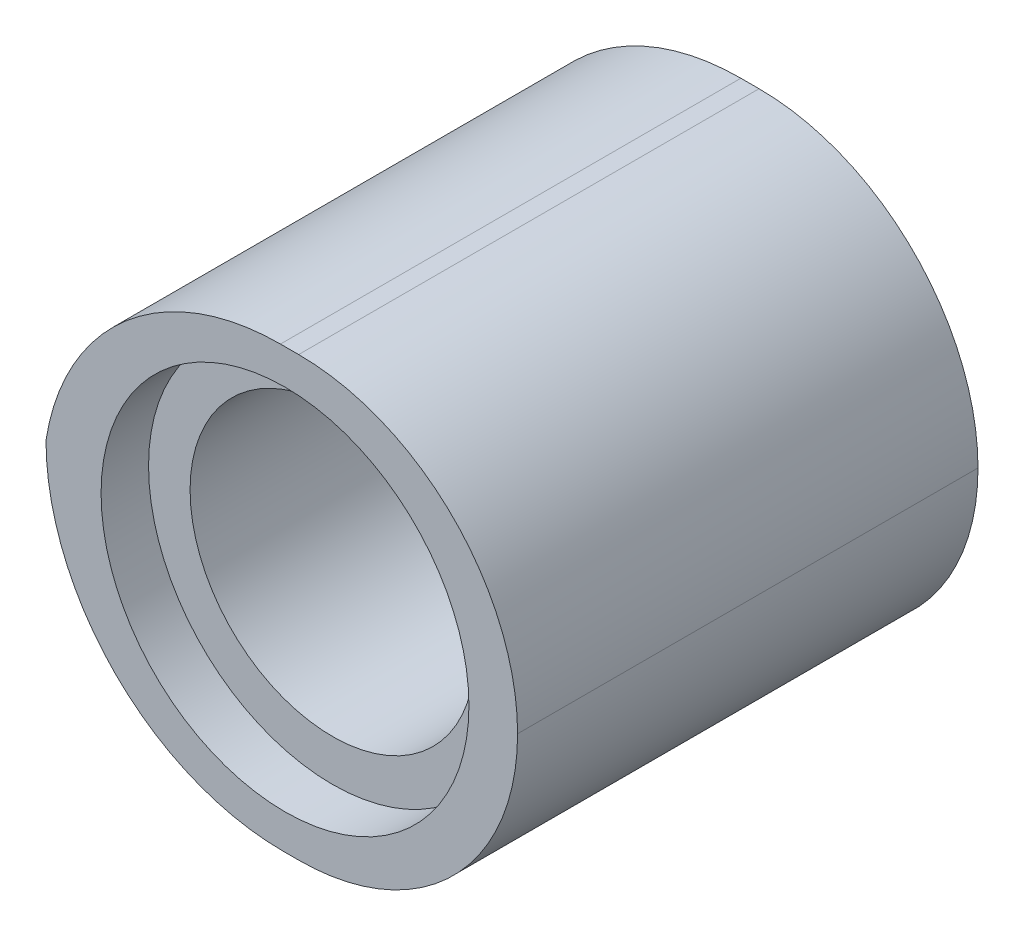
ISO-10303-21;
HEADER;
FILE_DESCRIPTION(('STEP AP214'),'2;1');
FILE_NAME('part.step','',(''),(''),'','','');
FILE_SCHEMA(('AUTOMOTIVE_DESIGN { 1 0 10303 214 1 1 1 1 }'));
ENDSEC;
DATA;
#1=APPLICATION_CONTEXT('core data for automotive mechanical design processes');
#2=APPLICATION_PROTOCOL_DEFINITION('international standard','automotive_design',2000,#1);
#3=PRODUCT_CONTEXT('',#1,'mechanical');
#4=PRODUCT('Part','Part','',(#3));
#5=PRODUCT_RELATED_PRODUCT_CATEGORY('part','',(#4));
#6=PRODUCT_DEFINITION_FORMATION('','',#4);
#7=PRODUCT_DEFINITION_CONTEXT('part definition',#1,'design');
#8=PRODUCT_DEFINITION('design','',#6,#7);
#9=PRODUCT_DEFINITION_SHAPE('','',#8);
#10=(LENGTH_UNIT() NAMED_UNIT(*) SI_UNIT(.MILLI.,.METRE.));
#11=(NAMED_UNIT(*) PLANE_ANGLE_UNIT() SI_UNIT($,.RADIAN.));
#12=(NAMED_UNIT(*) SI_UNIT($,.STERADIAN.) SOLID_ANGLE_UNIT());
#13=UNCERTAINTY_MEASURE_WITH_UNIT(LENGTH_MEASURE(1.E-05),#10,'distance_accuracy_value','');
#14=(GEOMETRIC_REPRESENTATION_CONTEXT(3) GLOBAL_UNCERTAINTY_ASSIGNED_CONTEXT((#13)) GLOBAL_UNIT_ASSIGNED_CONTEXT((#10,
#11,#12)) REPRESENTATION_CONTEXT('',''));
#15=CARTESIAN_POINT('',(0.,0.,0.));
#16=DIRECTION('',(0.,0.,1.));
#17=DIRECTION('',(1.,0.,0.));
#18=AXIS2_PLACEMENT_3D('',#15,#16,#17);
#19=CARTESIAN_POINT('',(35.31,3.69,7.76));
#20=DIRECTION('',(0.,0.,1.));
#21=DIRECTION('',(1.,0.,0.));
#22=AXIS2_PLACEMENT_3D('',#19,#20,#21);
#23=CYLINDRICAL_SURFACE('',#22,3.69);
#24=DIRECTION('',(0.,0.,1.));
#25=VECTOR('',#24,1.);
#26=CARTESIAN_POINT('',(35.31,0.,7.76));
#27=LINE('',#26,#25);
#28=CARTESIAN_POINT('',(35.31,0.,0.));
#29=VERTEX_POINT('',#28);
#30=CARTESIAN_POINT('',(35.31,0.,7.76));
#31=VERTEX_POINT('',#30);
#32=EDGE_CURVE('E98',#29,#31,#27,.T.);
#33=ORIENTED_EDGE('',*,*,#32,.F.);
#34=CARTESIAN_POINT('',(35.31,3.69,0.));
#35=DIRECTION('',(0.,0.,-1.));
#36=DIRECTION('',(-1.,0.,0.));
#37=AXIS2_PLACEMENT_3D('',#34,#35,#36);
#38=CIRCLE('',#37,3.69);
#39=CARTESIAN_POINT('',(39.,3.69,0.));
#40=VERTEX_POINT('',#39);
#41=EDGE_CURVE('E92',#40,#29,#38,.T.);
#42=ORIENTED_EDGE('',*,*,#41,.F.);
#43=DIRECTION('',(0.,0.,1.));
#44=VECTOR('',#43,1.);
#45=CARTESIAN_POINT('',(39.,3.69,7.76));
#46=LINE('',#45,#44);
#47=CARTESIAN_POINT('',(39.,3.69,7.76));
#48=VERTEX_POINT('',#47);
#49=EDGE_CURVE('E96',#40,#48,#46,.T.);
#50=ORIENTED_EDGE('',*,*,#49,.T.);
#51=CARTESIAN_POINT('',(35.31,3.69,7.76));
#52=DIRECTION('',(0.,0.,-1.));
#53=DIRECTION('',(-1.,0.,0.));
#54=AXIS2_PLACEMENT_3D('',#51,#52,#53);
#55=CIRCLE('',#54,3.69);
#56=EDGE_CURVE('E100',#31,#48,#55,.F.);
#57=ORIENTED_EDGE('',*,*,#56,.F.);
#58=EDGE_LOOP('',(#33,#42,#50,#57));
#59=FACE_BOUND('',#58,.T.);
#60=ADVANCED_FACE('F39',(#59),#23,.T.);
#61=CARTESIAN_POINT('',(35.31,3.69,7.76));
#62=DIRECTION('',(0.,0.,1.));
#63=DIRECTION('',(1.,0.,0.));
#64=AXIS2_PLACEMENT_3D('',#61,#62,#63);
#65=CYLINDRICAL_SURFACE('',#64,3.69);
#66=ORIENTED_EDGE('',*,*,#49,.F.);
#67=CARTESIAN_POINT('',(35.31,3.69,0.));
#68=DIRECTION('',(0.,0.,-1.));
#69=DIRECTION('',(-1.,0.,0.));
#70=AXIS2_PLACEMENT_3D('',#67,#68,#69);
#71=CIRCLE('',#70,3.69);
#72=CARTESIAN_POINT('',(35.31,7.38,0.));
#73=VERTEX_POINT('',#72);
#74=EDGE_CURVE('E102',#73,#40,#71,.T.);
#75=ORIENTED_EDGE('',*,*,#74,.F.);
#76=DIRECTION('',(0.,0.,1.));
#77=VECTOR('',#76,1.);
#78=CARTESIAN_POINT('',(35.31,7.38,7.76));
#79=LINE('',#78,#77);
#80=CARTESIAN_POINT('',(35.31,7.38,7.76));
#81=VERTEX_POINT('',#80);
#82=EDGE_CURVE('E109',#81,#73,#79,.F.);
#83=ORIENTED_EDGE('',*,*,#82,.F.);
#84=CARTESIAN_POINT('',(35.31,3.69,7.76));
#85=DIRECTION('',(0.,0.,-1.));
#86=DIRECTION('',(-1.,0.,0.));
#87=AXIS2_PLACEMENT_3D('',#84,#85,#86);
#88=CIRCLE('',#87,3.69);
#89=EDGE_CURVE('E108',#48,#81,#88,.F.);
#90=ORIENTED_EDGE('',*,*,#89,.F.);
#91=EDGE_LOOP('',(#66,#75,#83,#90));
#92=FACE_BOUND('',#91,.T.);
#93=ADVANCED_FACE('F112',(#92),#65,.T.);
#94=CARTESIAN_POINT('',(15.58,0.,6.95999999999999));
#95=DIRECTION('',(0.,0.,-1.));
#96=DIRECTION('',(-1.,0.,0.));
#97=AXIS2_PLACEMENT_3D('',#94,#95,#96);
#98=PLANE('',#97);
#99=CARTESIAN_POINT('',(35.08,3.69,6.96));
#100=DIRECTION('',(0.,0.,1.));
#101=DIRECTION('',(1.,0.,0.));
#102=AXIS2_PLACEMENT_3D('',#99,#100,#101);
#103=CIRCLE('',#102,3.1);
#104=CARTESIAN_POINT('',(38.18,3.69,6.96));
#105=VERTEX_POINT('',#104);
#106=EDGE_CURVE('E113',#105,#105,#103,.T.);
#107=ORIENTED_EDGE('',*,*,#106,.T.);
#108=EDGE_LOOP('',(#107));
#109=FACE_BOUND('',#108,.T.);
#110=CARTESIAN_POINT('',(35.08,3.69,6.95999999999999));
#111=DIRECTION('',(0.,0.,-1.));
#112=DIRECTION('',(-1.,0.,0.));
#113=AXIS2_PLACEMENT_3D('',#110,#111,#112);
#114=CIRCLE('',#113,2.4);
#115=CARTESIAN_POINT('',(32.68,3.69,6.95999999999999));
#116=VERTEX_POINT('',#115);
#117=EDGE_CURVE('E155',#116,#116,#114,.F.);
#118=ORIENTED_EDGE('',*,*,#117,.F.);
#119=EDGE_LOOP('',(#118));
#120=FACE_BOUND('',#119,.T.);
#121=ADVANCED_FACE('F179',(#109,#120),#98,.F.);
#122=CARTESIAN_POINT('',(35.08,3.69,7.76));
#123=DIRECTION('',(0.,0.,-1.));
#124=DIRECTION('',(-1.,0.,0.));
#125=AXIS2_PLACEMENT_3D('',#122,#123,#124);
#126=CYLINDRICAL_SURFACE('',#125,3.1);
#127=CARTESIAN_POINT('',(35.08,3.69,7.76));
#128=DIRECTION('',(0.,0.,1.));
#129=DIRECTION('',(1.,0.,0.));
#130=AXIS2_PLACEMENT_3D('',#127,#128,#129);
#131=CIRCLE('',#130,3.1);
#132=CARTESIAN_POINT('',(38.18,3.69,7.76));
#133=VERTEX_POINT('',#132);
#134=EDGE_CURVE('E117',#133,#133,#131,.T.);
#135=ORIENTED_EDGE('',*,*,#134,.T.);
#136=EDGE_LOOP('',(#135));
#137=FACE_BOUND('',#136,.T.);
#138=ORIENTED_EDGE('',*,*,#106,.F.);
#139=EDGE_LOOP('',(#138));
#140=FACE_BOUND('',#139,.T.);
#141=ADVANCED_FACE('F160',(#137,#140),#126,.F.);
#142=CARTESIAN_POINT('',(35.08,3.69,0.));
#143=DIRECTION('',(0.,0.,1.));
#144=DIRECTION('',(1.,0.,0.));
#145=AXIS2_PLACEMENT_3D('',#142,#143,#144);
#146=CYLINDRICAL_SURFACE('',#145,2.4);
#147=ORIENTED_EDGE('',*,*,#117,.T.);
#148=EDGE_LOOP('',(#147));
#149=FACE_BOUND('',#148,.T.);
#150=CARTESIAN_POINT('',(35.08,3.69,0.8));
#151=DIRECTION('',(0.,0.,-1.));
#152=DIRECTION('',(-1.,0.,0.));
#153=AXIS2_PLACEMENT_3D('',#150,#151,#152);
#154=CIRCLE('',#153,2.4);
#155=CARTESIAN_POINT('',(32.68,3.69,0.8));
#156=VERTEX_POINT('',#155);
#157=EDGE_CURVE('E151',#156,#156,#154,.F.);
#158=ORIENTED_EDGE('',*,*,#157,.F.);
#159=EDGE_LOOP('',(#158));
#160=FACE_BOUND('',#159,.T.);
#161=ADVANCED_FACE('F196',(#149,#160),#146,.F.);
#162=CARTESIAN_POINT('',(0.,0.,7.76));
#163=DIRECTION('',(0.,1.,0.));
#164=DIRECTION('',(0.,0.,1.));
#165=AXIS2_PLACEMENT_3D('',#162,#163,#164);
#166=PLANE('',#165);
#167=DIRECTION('',(1.,0.,0.));
#168=VECTOR('',#167,1.);
#169=CARTESIAN_POINT('',(0.,0.,7.76));
#170=LINE('',#169,#168);
#171=CARTESIAN_POINT('',(35.0516644975421,0.,7.76));
#172=VERTEX_POINT('',#171);
#173=EDGE_CURVE('E147',#172,#31,#170,.T.);
#174=ORIENTED_EDGE('',*,*,#173,.F.);
#175=DIRECTION('',(0.,0.,-1.));
#176=VECTOR('',#175,1.);
#177=CARTESIAN_POINT('',(35.0516644975421,0.,7.76));
#178=LINE('',#177,#176);
#179=CARTESIAN_POINT('',(35.0516644975421,0.,0.));
#180=VERTEX_POINT('',#179);
#181=EDGE_CURVE('E124',#172,#180,#178,.T.);
#182=ORIENTED_EDGE('',*,*,#181,.T.);
#183=DIRECTION('',(1.,0.,0.));
#184=VECTOR('',#183,1.);
#185=CARTESIAN_POINT('',(0.,0.,0.));
#186=LINE('',#185,#184);
#187=EDGE_CURVE('E148',#180,#29,#186,.T.);
#188=ORIENTED_EDGE('',*,*,#187,.T.);
#189=ORIENTED_EDGE('',*,*,#32,.T.);
#190=EDGE_LOOP('',(#174,#182,#188,#189));
#191=FACE_BOUND('',#190,.T.);
#192=ADVANCED_FACE('F171',(#191),#166,.F.);
#193=CARTESIAN_POINT('',(0.,7.38,7.76));
#194=DIRECTION('',(0.,-1.,0.));
#195=DIRECTION('',(0.,0.,-1.));
#196=AXIS2_PLACEMENT_3D('',#193,#194,#195);
#197=PLANE('',#196);
#198=DIRECTION('',(-1.,0.,0.));
#199=VECTOR('',#198,1.);
#200=CARTESIAN_POINT('',(0.,7.38,0.));
#201=LINE('',#200,#199);
#202=CARTESIAN_POINT('',(35.0033223774705,7.38,0.));
#203=VERTEX_POINT('',#202);
#204=EDGE_CURVE('E104',#73,#203,#201,.T.);
#205=ORIENTED_EDGE('',*,*,#204,.T.);
#206=DIRECTION('',(0.,0.,-1.));
#207=VECTOR('',#206,1.);
#208=CARTESIAN_POINT('',(35.0033223774705,7.38,7.76));
#209=LINE('',#208,#207);
#210=CARTESIAN_POINT('',(35.0033223774705,7.38,7.76));
#211=VERTEX_POINT('',#210);
#212=EDGE_CURVE('E133',#203,#211,#209,.F.);
#213=ORIENTED_EDGE('',*,*,#212,.T.);
#214=DIRECTION('',(-1.,0.,0.));
#215=VECTOR('',#214,1.);
#216=CARTESIAN_POINT('',(0.,7.38,7.76));
#217=LINE('',#216,#215);
#218=EDGE_CURVE('E140',#81,#211,#217,.T.);
#219=ORIENTED_EDGE('',*,*,#218,.F.);
#220=ORIENTED_EDGE('',*,*,#82,.T.);
#221=EDGE_LOOP('',(#205,#213,#219,#220));
#222=FACE_BOUND('',#221,.T.);
#223=ADVANCED_FACE('F146',(#222),#197,.F.);
#224=CARTESIAN_POINT('',(0.,0.,7.76));
#225=DIRECTION('',(0.,0.,-1.));
#226=DIRECTION('',(-1.,0.,0.));
#227=AXIS2_PLACEMENT_3D('',#224,#225,#226);
#228=PLANE('',#227);
#229=ORIENTED_EDGE('',*,*,#134,.F.);
#230=EDGE_LOOP('',(#229));
#231=FACE_BOUND('',#230,.T.);
#232=ORIENTED_EDGE('',*,*,#218,.T.);
#233=CARTESIAN_POINT('',(35.0033223774705,3.38,7.76));
#234=DIRECTION('',(0.,0.,-1.));
#235=DIRECTION('',(-1.,0.,0.));
#236=AXIS2_PLACEMENT_3D('',#233,#234,#235);
#237=CIRCLE('',#236,4.);
#238=CARTESIAN_POINT('',(31.0516644975421,4.,7.76));
#239=VERTEX_POINT('',#238);
#240=EDGE_CURVE('E47',#211,#239,#237,.F.);
#241=ORIENTED_EDGE('',*,*,#240,.T.);
#242=CARTESIAN_POINT('',(35.0516644975421,4.,7.76));
#243=DIRECTION('',(0.,0.,-1.));
#244=DIRECTION('',(-1.,0.,0.));
#245=AXIS2_PLACEMENT_3D('',#242,#243,#244);
#246=CIRCLE('',#245,4.);
#247=EDGE_CURVE('E131',#239,#172,#246,.F.);
#248=ORIENTED_EDGE('',*,*,#247,.T.);
#249=ORIENTED_EDGE('',*,*,#173,.T.);
#250=ORIENTED_EDGE('',*,*,#56,.T.);
#251=ORIENTED_EDGE('',*,*,#89,.T.);
#252=EDGE_LOOP('',(#232,#241,#248,#249,#250,#251));
#253=FACE_BOUND('',#252,.T.);
#254=ADVANCED_FACE('F137',(#231,#253),#228,.F.);
#255=CARTESIAN_POINT('',(0.,0.,0.));
#256=DIRECTION('',(0.,0.,-1.));
#257=DIRECTION('',(-1.,0.,0.));
#258=AXIS2_PLACEMENT_3D('',#255,#256,#257);
#259=PLANE('',#258);
#260=CARTESIAN_POINT('',(35.0516644975421,4.,0.));
#261=DIRECTION('',(0.,0.,-1.));
#262=DIRECTION('',(-1.,0.,0.));
#263=AXIS2_PLACEMENT_3D('',#260,#261,#262);
#264=CIRCLE('',#263,4.);
#265=CARTESIAN_POINT('',(31.0516644975421,4.,0.));
#266=VERTEX_POINT('',#265);
#267=EDGE_CURVE('E127',#180,#266,#264,.T.);
#268=ORIENTED_EDGE('',*,*,#267,.T.);
#269=CARTESIAN_POINT('',(35.0033223774705,3.38,0.));
#270=DIRECTION('',(0.,0.,-1.));
#271=DIRECTION('',(-1.,0.,0.));
#272=AXIS2_PLACEMENT_3D('',#269,#270,#271);
#273=CIRCLE('',#272,4.);
#274=EDGE_CURVE('E12',#266,#203,#273,.T.);
#275=ORIENTED_EDGE('',*,*,#274,.T.);
#276=ORIENTED_EDGE('',*,*,#204,.F.);
#277=ORIENTED_EDGE('',*,*,#74,.T.);
#278=ORIENTED_EDGE('',*,*,#41,.T.);
#279=ORIENTED_EDGE('',*,*,#187,.F.);
#280=EDGE_LOOP('',(#268,#275,#276,#277,#278,#279));
#281=FACE_BOUND('',#280,.T.);
#282=ADVANCED_FACE('F103',(#281),#259,.T.);
#283=CARTESIAN_POINT('',(35.0516644975421,4.,7.76));
#284=DIRECTION('',(0.,0.,-1.));
#285=DIRECTION('',(-1.,0.,0.));
#286=AXIS2_PLACEMENT_3D('',#283,#284,#285);
#287=CYLINDRICAL_SURFACE('',#286,4.);
#288=ORIENTED_EDGE('',*,*,#247,.F.);
#289=DIRECTION('',(0.,0.,-1.));
#290=VECTOR('',#289,1.);
#291=CARTESIAN_POINT('',(31.0516644975421,4.,10.));
#292=LINE('',#291,#290);
#293=EDGE_CURVE('E129',#266,#239,#292,.F.);
#294=ORIENTED_EDGE('',*,*,#293,.F.);
#295=ORIENTED_EDGE('',*,*,#267,.F.);
#296=ORIENTED_EDGE('',*,*,#181,.F.);
#297=EDGE_LOOP('',(#288,#294,#295,#296));
#298=FACE_BOUND('',#297,.T.);
#299=ADVANCED_FACE('F144',(#298),#287,.T.);
#300=CARTESIAN_POINT('',(35.0033223774705,3.38,10.));
#301=DIRECTION('',(0.,0.,-1.));
#302=DIRECTION('',(-1.,0.,0.));
#303=AXIS2_PLACEMENT_3D('',#300,#301,#302);
#304=CYLINDRICAL_SURFACE('',#303,4.);
#305=ORIENTED_EDGE('',*,*,#274,.F.);
#306=ORIENTED_EDGE('',*,*,#293,.T.);
#307=ORIENTED_EDGE('',*,*,#240,.F.);
#308=ORIENTED_EDGE('',*,*,#212,.F.);
#309=EDGE_LOOP('',(#305,#306,#307,#308));
#310=FACE_BOUND('',#309,.T.);
#311=ADVANCED_FACE('F41',(#310),#304,.T.);
#312=CARTESIAN_POINT('',(0.,0.,0.8));
#313=DIRECTION('',(0.,0.,-1.));
#314=DIRECTION('',(-1.,0.,0.));
#315=AXIS2_PLACEMENT_3D('',#312,#313,#314);
#316=PLANE('',#315);
#317=ORIENTED_EDGE('',*,*,#157,.T.);
#318=EDGE_LOOP('',(#317));
#319=FACE_BOUND('',#318,.T.);
#320=ADVANCED_FACE('F185',(#319),#316,.F.);
#321=CLOSED_SHELL('',(#60,#93,#121,#141,#161,#192,#223,#254,#282,#299,#311,#320));
#322=MANIFOLD_SOLID_BREP('B2',#321);
#323=ADVANCED_BREP_SHAPE_REPRESENTATION('',(#18,#322),#14);
#324=SHAPE_DEFINITION_REPRESENTATION(#9,#323);
ENDSEC;
END-ISO-10303-21;
